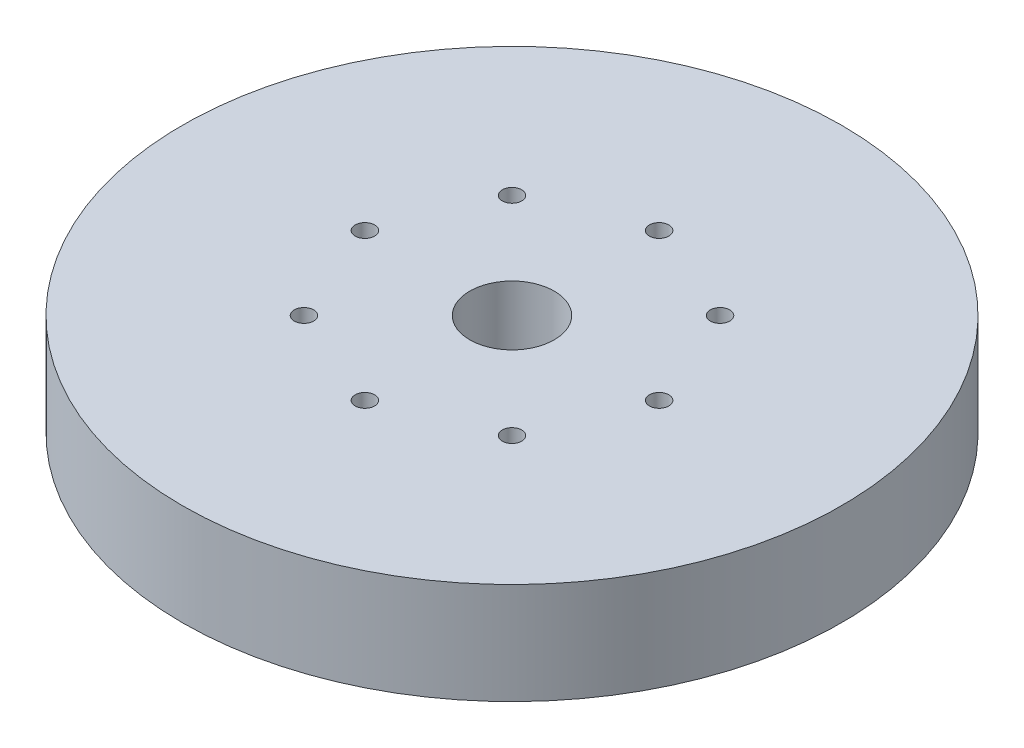
ISO-10303-21;
HEADER;
FILE_DESCRIPTION(('STEP AP214'),'2;1');
FILE_NAME('part.step','',(''),(''),'','','');
FILE_SCHEMA(('AUTOMOTIVE_DESIGN { 1 0 10303 214 1 1 1 1 }'));
ENDSEC;
DATA;
#1=APPLICATION_CONTEXT('core data for automotive mechanical design processes');
#2=APPLICATION_PROTOCOL_DEFINITION('international standard','automotive_design',2000,#1);
#3=PRODUCT_CONTEXT('',#1,'mechanical');
#4=PRODUCT('Part','Part','',(#3));
#5=PRODUCT_RELATED_PRODUCT_CATEGORY('part','',(#4));
#6=PRODUCT_DEFINITION_FORMATION('','',#4);
#7=PRODUCT_DEFINITION_CONTEXT('part definition',#1,'design');
#8=PRODUCT_DEFINITION('design','',#6,#7);
#9=PRODUCT_DEFINITION_SHAPE('','',#8);
#10=(LENGTH_UNIT() NAMED_UNIT(*) SI_UNIT(.MILLI.,.METRE.));
#11=(NAMED_UNIT(*) PLANE_ANGLE_UNIT() SI_UNIT($,.RADIAN.));
#12=(NAMED_UNIT(*) SI_UNIT($,.STERADIAN.) SOLID_ANGLE_UNIT());
#13=UNCERTAINTY_MEASURE_WITH_UNIT(LENGTH_MEASURE(1.E-05),#10,'distance_accuracy_value','');
#14=(GEOMETRIC_REPRESENTATION_CONTEXT(3) GLOBAL_UNCERTAINTY_ASSIGNED_CONTEXT((#13)) GLOBAL_UNIT_ASSIGNED_CONTEXT((#10,
#11,#12)) REPRESENTATION_CONTEXT('',''));
#15=CARTESIAN_POINT('',(0.,0.,0.));
#16=DIRECTION('',(0.,0.,1.));
#17=DIRECTION('',(1.,0.,0.));
#18=AXIS2_PLACEMENT_3D('',#15,#16,#17);
#19=CARTESIAN_POINT('',(0.,30.,0.));
#20=DIRECTION('',(0.,-1.,0.));
#21=DIRECTION('',(0.,0.,-1.));
#22=AXIS2_PLACEMENT_3D('',#19,#20,#21);
#23=CYLINDRICAL_SURFACE('',#22,97.5);
#24=CARTESIAN_POINT('',(0.,30.,0.));
#25=DIRECTION('',(0.,1.,0.));
#26=DIRECTION('',(0.,0.,1.));
#27=AXIS2_PLACEMENT_3D('',#24,#25,#26);
#28=CIRCLE('',#27,97.5);
#29=CARTESIAN_POINT('',(0.,30.,97.5));
#30=VERTEX_POINT('',#29);
#31=EDGE_CURVE('E10',#30,#30,#28,.T.);
#32=ORIENTED_EDGE('',*,*,#31,.F.);
#33=EDGE_LOOP('',(#32));
#34=FACE_BOUND('',#33,.T.);
#35=CARTESIAN_POINT('',(0.,0.,0.));
#36=DIRECTION('',(0.,1.,0.));
#37=DIRECTION('',(0.,0.,1.));
#38=AXIS2_PLACEMENT_3D('',#35,#36,#37);
#39=CIRCLE('',#38,97.5);
#40=CARTESIAN_POINT('',(0.,0.,97.5));
#41=VERTEX_POINT('',#40);
#42=EDGE_CURVE('E37',#41,#41,#39,.T.);
#43=ORIENTED_EDGE('',*,*,#42,.T.);
#44=EDGE_LOOP('',(#43));
#45=FACE_BOUND('',#44,.T.);
#46=ADVANCED_FACE('F40',(#34,#45),#23,.T.);
#47=CARTESIAN_POINT('',(0.,30.,0.));
#48=DIRECTION('',(0.,1.,0.));
#49=DIRECTION('',(0.,0.,1.));
#50=AXIS2_PLACEMENT_3D('',#47,#48,#49);
#51=PLANE('',#50);
#52=CARTESIAN_POINT('',(1.51956807422013E-13,30.,43.5221594145374));
#53=DIRECTION('',(0.,1.,0.));
#54=DIRECTION('',(1.,0.,0.));
#55=AXIS2_PLACEMENT_3D('',#52,#53,#54);
#56=CIRCLE('',#55,2.87571283902707);
#57=CARTESIAN_POINT('',(2.87571283902722,30.,43.5221594145374));
#58=VERTEX_POINT('',#57);
#59=EDGE_CURVE('E88',#58,#58,#56,.T.);
#60=ORIENTED_EDGE('',*,*,#59,.F.);
#61=EDGE_LOOP('',(#60));
#62=FACE_BOUND('',#61,.T.);
#63=CARTESIAN_POINT('',(30.7748140539015,30.,30.7748140539012));
#64=DIRECTION('',(0.,1.,0.));
#65=DIRECTION('',(0.707106781186544,0.,-0.707106781186551));
#66=AXIS2_PLACEMENT_3D('',#63,#64,#65);
#67=CIRCLE('',#66,2.87571283902707);
#68=CARTESIAN_POINT('',(32.8082501031228,30.,28.7413780046799));
#69=VERTEX_POINT('',#68);
#70=EDGE_CURVE('E79',#69,#69,#67,.T.);
#71=ORIENTED_EDGE('',*,*,#70,.F.);
#72=EDGE_LOOP('',(#71));
#73=FACE_BOUND('',#72,.T.);
#74=CARTESIAN_POINT('',(43.5221594145374,30.,0.));
#75=DIRECTION('',(0.,1.,0.));
#76=DIRECTION('',(0.,0.,-1.));
#77=AXIS2_PLACEMENT_3D('',#74,#75,#76);
#78=CIRCLE('',#77,2.87571283902707);
#79=CARTESIAN_POINT('',(43.5221594145374,30.,-2.87571283902707));
#80=VERTEX_POINT('',#79);
#81=EDGE_CURVE('E74',#80,#80,#78,.T.);
#82=ORIENTED_EDGE('',*,*,#81,.F.);
#83=EDGE_LOOP('',(#82));
#84=FACE_BOUND('',#83,.T.);
#85=CARTESIAN_POINT('',(30.7748140539011,30.,-30.7748140539016));
#86=DIRECTION('',(0.,1.,0.));
#87=DIRECTION('',(-0.707106781186554,0.,-0.707106781186541));
#88=AXIS2_PLACEMENT_3D('',#85,#86,#87);
#89=CIRCLE('',#88,2.87571283902707);
#90=CARTESIAN_POINT('',(28.7413780046798,30.,-32.8082501031229));
#91=VERTEX_POINT('',#90);
#92=EDGE_CURVE('E70',#91,#91,#89,.T.);
#93=ORIENTED_EDGE('',*,*,#92,.F.);
#94=EDGE_LOOP('',(#93));
#95=FACE_BOUND('',#94,.T.);
#96=CARTESIAN_POINT('',(-4.5587042226604E-13,30.,-43.5221594145374));
#97=DIRECTION('',(0.,1.,0.));
#98=DIRECTION('',(-1.,0.,0.));
#99=AXIS2_PLACEMENT_3D('',#96,#97,#98);
#100=CIRCLE('',#99,2.87571283902707);
#101=CARTESIAN_POINT('',(-2.87571283902752,30.,-43.5221594145374));
#102=VERTEX_POINT('',#101);
#103=EDGE_CURVE('E100',#102,#102,#100,.T.);
#104=ORIENTED_EDGE('',*,*,#103,.F.);
#105=EDGE_LOOP('',(#104));
#106=FACE_BOUND('',#105,.T.);
#107=CARTESIAN_POINT('',(-30.7748140539017,30.,-30.774814053901));
#108=DIRECTION('',(0.,1.,0.));
#109=DIRECTION('',(-0.707106781186539,0.,0.707106781186556));
#110=AXIS2_PLACEMENT_3D('',#107,#108,#109);
#111=CIRCLE('',#110,2.87571283902707);
#112=CARTESIAN_POINT('',(-32.808250103123,30.,-28.7413780046797));
#113=VERTEX_POINT('',#112);
#114=EDGE_CURVE('E93',#113,#113,#111,.T.);
#115=ORIENTED_EDGE('',*,*,#114,.F.);
#116=EDGE_LOOP('',(#115));
#117=FACE_BOUND('',#116,.T.);
#118=CARTESIAN_POINT('',(-30.7748140539013,30.,30.7748140539014));
#119=DIRECTION('',(0.,1.,0.));
#120=DIRECTION('',(0.707106781186549,0.,0.707106781186546));
#121=AXIS2_PLACEMENT_3D('',#118,#119,#120);
#122=CIRCLE('',#121,2.87571283902707);
#123=CARTESIAN_POINT('',(-28.7413780046801,30.,32.8082501031227));
#124=VERTEX_POINT('',#123);
#125=EDGE_CURVE('E61',#124,#124,#122,.T.);
#126=ORIENTED_EDGE('',*,*,#125,.F.);
#127=EDGE_LOOP('',(#126));
#128=FACE_BOUND('',#127,.T.);
#129=CARTESIAN_POINT('',(-43.5221594145374,30.,0.));
#130=DIRECTION('',(0.,1.,0.));
#131=DIRECTION('',(0.,0.,1.));
#132=AXIS2_PLACEMENT_3D('',#129,#130,#131);
#133=CIRCLE('',#132,2.87571283902707);
#134=CARTESIAN_POINT('',(-43.5221594145374,30.,2.87571283902707));
#135=VERTEX_POINT('',#134);
#136=EDGE_CURVE('E54',#135,#135,#133,.T.);
#137=ORIENTED_EDGE('',*,*,#136,.F.);
#138=EDGE_LOOP('',(#137));
#139=FACE_BOUND('',#138,.T.);
#140=CARTESIAN_POINT('',(0.,30.,0.));
#141=DIRECTION('',(0.,1.,0.));
#142=DIRECTION('',(0.,0.,1.));
#143=AXIS2_PLACEMENT_3D('',#140,#141,#142);
#144=CIRCLE('',#143,12.5);
#145=CARTESIAN_POINT('',(0.,30.,12.5));
#146=VERTEX_POINT('',#145);
#147=EDGE_CURVE('E50',#146,#146,#144,.T.);
#148=ORIENTED_EDGE('',*,*,#147,.F.);
#149=EDGE_LOOP('',(#148));
#150=FACE_BOUND('',#149,.T.);
#151=ORIENTED_EDGE('',*,*,#31,.T.);
#152=EDGE_LOOP('',(#151));
#153=FACE_BOUND('',#152,.T.);
#154=ADVANCED_FACE('F115',(#62,#73,#84,#95,#106,#117,#128,#139,#150,#153),#51,.T.);
#155=CARTESIAN_POINT('',(0.,0.,0.));
#156=DIRECTION('',(0.,1.,0.));
#157=DIRECTION('',(0.,0.,1.));
#158=AXIS2_PLACEMENT_3D('',#155,#156,#157);
#159=PLANE('',#158);
#160=CARTESIAN_POINT('',(0.,0.,0.));
#161=DIRECTION('',(0.,1.,0.));
#162=DIRECTION('',(0.,0.,1.));
#163=AXIS2_PLACEMENT_3D('',#160,#161,#162);
#164=CIRCLE('',#163,12.5);
#165=CARTESIAN_POINT('',(0.,0.,12.5));
#166=VERTEX_POINT('',#165);
#167=EDGE_CURVE('E47',#166,#166,#164,.T.);
#168=ORIENTED_EDGE('',*,*,#167,.T.);
#169=EDGE_LOOP('',(#168));
#170=FACE_BOUND('',#169,.T.);
#171=ORIENTED_EDGE('',*,*,#42,.F.);
#172=EDGE_LOOP('',(#171));
#173=FACE_BOUND('',#172,.T.);
#174=ADVANCED_FACE('F113',(#170,#173),#159,.F.);
#175=CARTESIAN_POINT('',(0.,30.,0.));
#176=DIRECTION('',(0.,-1.,0.));
#177=DIRECTION('',(0.,0.,-1.));
#178=AXIS2_PLACEMENT_3D('',#175,#176,#177);
#179=CYLINDRICAL_SURFACE('',#178,12.5);
#180=ORIENTED_EDGE('',*,*,#147,.T.);
#181=EDGE_LOOP('',(#180));
#182=FACE_BOUND('',#181,.T.);
#183=ORIENTED_EDGE('',*,*,#167,.F.);
#184=EDGE_LOOP('',(#183));
#185=FACE_BOUND('',#184,.T.);
#186=ADVANCED_FACE('F127',(#182,#185),#179,.F.);
#187=CARTESIAN_POINT('',(-43.5221594145374,7.41410904597395,0.));
#188=DIRECTION('',(0.,1.,0.));
#189=DIRECTION('',(0.,0.,1.));
#190=AXIS2_PLACEMENT_3D('',#187,#188,#189);
#191=CYLINDRICAL_SURFACE('',#190,2.87571283902707);
#192=CARTESIAN_POINT('',(-43.5221594145374,7.41410904597395,0.));
#193=DIRECTION('',(0.,1.,0.));
#194=DIRECTION('',(0.,0.,1.));
#195=AXIS2_PLACEMENT_3D('',#192,#193,#194);
#196=CIRCLE('',#195,2.87571283902707);
#197=CARTESIAN_POINT('',(-43.5221594145374,7.41410904597395,2.87571283902707));
#198=VERTEX_POINT('',#197);
#199=EDGE_CURVE('E55',#198,#198,#196,.T.);
#200=ORIENTED_EDGE('',*,*,#199,.F.);
#201=EDGE_LOOP('',(#200));
#202=FACE_BOUND('',#201,.T.);
#203=ORIENTED_EDGE('',*,*,#136,.T.);
#204=EDGE_LOOP('',(#203));
#205=FACE_BOUND('',#204,.T.);
#206=ADVANCED_FACE('F129',(#202,#205),#191,.F.);
#207=CARTESIAN_POINT('',(-43.5221594145374,7.41410904597395,0.));
#208=DIRECTION('',(0.,1.,0.));
#209=DIRECTION('',(0.,0.,1.));
#210=AXIS2_PLACEMENT_3D('',#207,#208,#209);
#211=PLANE('',#210);
#212=ORIENTED_EDGE('',*,*,#199,.T.);
#213=EDGE_LOOP('',(#212));
#214=FACE_BOUND('',#213,.T.);
#215=ADVANCED_FACE('F157',(#214),#211,.T.);
#216=CARTESIAN_POINT('',(-30.7748140539013,7.41410904597395,30.7748140539014));
#217=DIRECTION('',(0.,1.,0.));
#218=DIRECTION('',(0.,0.,1.));
#219=AXIS2_PLACEMENT_3D('',#216,#217,#218);
#220=CYLINDRICAL_SURFACE('',#219,2.87571283902707);
#221=CARTESIAN_POINT('',(-30.7748140539013,7.41410904597395,30.7748140539014));
#222=DIRECTION('',(0.,1.,0.));
#223=DIRECTION('',(0.707106781186549,0.,0.707106781186546));
#224=AXIS2_PLACEMENT_3D('',#221,#222,#223);
#225=CIRCLE('',#224,2.87571283902707);
#226=CARTESIAN_POINT('',(-28.7413780046801,7.41410904597395,32.8082501031227));
#227=VERTEX_POINT('',#226);
#228=EDGE_CURVE('E59',#227,#227,#225,.T.);
#229=ORIENTED_EDGE('',*,*,#228,.F.);
#230=EDGE_LOOP('',(#229));
#231=FACE_BOUND('',#230,.T.);
#232=ORIENTED_EDGE('',*,*,#125,.T.);
#233=EDGE_LOOP('',(#232));
#234=FACE_BOUND('',#233,.T.);
#235=ADVANCED_FACE('F170',(#231,#234),#220,.F.);
#236=CARTESIAN_POINT('',(-30.7748140539013,7.41410904597395,30.7748140539014));
#237=DIRECTION('',(0.,1.,0.));
#238=DIRECTION('',(0.707106781186549,0.,0.707106781186546));
#239=AXIS2_PLACEMENT_3D('',#236,#237,#238);
#240=PLANE('',#239);
#241=ORIENTED_EDGE('',*,*,#228,.T.);
#242=EDGE_LOOP('',(#241));
#243=FACE_BOUND('',#242,.T.);
#244=ADVANCED_FACE('F182',(#243),#240,.T.);
#245=CARTESIAN_POINT('',(-30.7748140539017,7.41410904597395,-30.774814053901));
#246=DIRECTION('',(0.,1.,0.));
#247=DIRECTION('',(0.,0.,1.));
#248=AXIS2_PLACEMENT_3D('',#245,#246,#247);
#249=CYLINDRICAL_SURFACE('',#248,2.87571283902707);
#250=CARTESIAN_POINT('',(-30.7748140539017,7.41410904597395,-30.774814053901));
#251=DIRECTION('',(0.,1.,0.));
#252=DIRECTION('',(-0.707106781186539,0.,0.707106781186556));
#253=AXIS2_PLACEMENT_3D('',#250,#251,#252);
#254=CIRCLE('',#253,2.87571283902707);
#255=CARTESIAN_POINT('',(-32.808250103123,7.41410904597395,-28.7413780046797));
#256=VERTEX_POINT('',#255);
#257=EDGE_CURVE('E94',#256,#256,#254,.T.);
#258=ORIENTED_EDGE('',*,*,#257,.F.);
#259=EDGE_LOOP('',(#258));
#260=FACE_BOUND('',#259,.T.);
#261=ORIENTED_EDGE('',*,*,#114,.T.);
#262=EDGE_LOOP('',(#261));
#263=FACE_BOUND('',#262,.T.);
#264=ADVANCED_FACE('F189',(#260,#263),#249,.F.);
#265=CARTESIAN_POINT('',(-30.7748140539017,7.41410904597395,-30.774814053901));
#266=DIRECTION('',(0.,1.,0.));
#267=DIRECTION('',(-0.707106781186539,0.,0.707106781186556));
#268=AXIS2_PLACEMENT_3D('',#265,#266,#267);
#269=PLANE('',#268);
#270=ORIENTED_EDGE('',*,*,#257,.T.);
#271=EDGE_LOOP('',(#270));
#272=FACE_BOUND('',#271,.T.);
#273=ADVANCED_FACE('F107',(#272),#269,.T.);
#274=CARTESIAN_POINT('',(-4.5587042226604E-13,7.41410904597395,-43.5221594145374));
#275=DIRECTION('',(0.,1.,0.));
#276=DIRECTION('',(0.,0.,1.));
#277=AXIS2_PLACEMENT_3D('',#274,#275,#276);
#278=CYLINDRICAL_SURFACE('',#277,2.87571283902707);
#279=CARTESIAN_POINT('',(-4.5587042226604E-13,7.41410904597395,-43.5221594145374));
#280=DIRECTION('',(0.,1.,0.));
#281=DIRECTION('',(-1.,0.,0.));
#282=AXIS2_PLACEMENT_3D('',#279,#280,#281);
#283=CIRCLE('',#282,2.87571283902707);
#284=CARTESIAN_POINT('',(-2.87571283902752,7.41410904597395,-43.5221594145374));
#285=VERTEX_POINT('',#284);
#286=EDGE_CURVE('E72',#285,#285,#283,.T.);
#287=ORIENTED_EDGE('',*,*,#286,.F.);
#288=EDGE_LOOP('',(#287));
#289=FACE_BOUND('',#288,.T.);
#290=ORIENTED_EDGE('',*,*,#103,.T.);
#291=EDGE_LOOP('',(#290));
#292=FACE_BOUND('',#291,.T.);
#293=ADVANCED_FACE('F104',(#289,#292),#278,.F.);
#294=CARTESIAN_POINT('',(-4.5587042226604E-13,7.41410904597395,-43.5221594145374));
#295=DIRECTION('',(0.,1.,0.));
#296=DIRECTION('',(-1.,0.,0.));
#297=AXIS2_PLACEMENT_3D('',#294,#295,#296);
#298=PLANE('',#297);
#299=ORIENTED_EDGE('',*,*,#286,.T.);
#300=EDGE_LOOP('',(#299));
#301=FACE_BOUND('',#300,.T.);
#302=ADVANCED_FACE('F103',(#301),#298,.T.);
#303=CARTESIAN_POINT('',(30.7748140539011,7.41410904597395,-30.7748140539016));
#304=DIRECTION('',(0.,1.,0.));
#305=DIRECTION('',(0.,0.,1.));
#306=AXIS2_PLACEMENT_3D('',#303,#304,#305);
#307=CYLINDRICAL_SURFACE('',#306,2.87571283902707);
#308=CARTESIAN_POINT('',(30.7748140539011,7.41410904597395,-30.7748140539016));
#309=DIRECTION('',(0.,1.,0.));
#310=DIRECTION('',(-0.707106781186554,0.,-0.707106781186541));
#311=AXIS2_PLACEMENT_3D('',#308,#309,#310);
#312=CIRCLE('',#311,2.87571283902707);
#313=CARTESIAN_POINT('',(28.7413780046798,7.41410904597395,-32.8082501031229));
#314=VERTEX_POINT('',#313);
#315=EDGE_CURVE('E69',#314,#314,#312,.T.);
#316=ORIENTED_EDGE('',*,*,#315,.F.);
#317=EDGE_LOOP('',(#316));
#318=FACE_BOUND('',#317,.T.);
#319=ORIENTED_EDGE('',*,*,#92,.T.);
#320=EDGE_LOOP('',(#319));
#321=FACE_BOUND('',#320,.T.);
#322=ADVANCED_FACE('F219',(#318,#321),#307,.F.);
#323=CARTESIAN_POINT('',(30.7748140539011,7.41410904597395,-30.7748140539016));
#324=DIRECTION('',(0.,1.,0.));
#325=DIRECTION('',(-0.707106781186554,0.,-0.707106781186541));
#326=AXIS2_PLACEMENT_3D('',#323,#324,#325);
#327=PLANE('',#326);
#328=ORIENTED_EDGE('',*,*,#315,.T.);
#329=EDGE_LOOP('',(#328));
#330=FACE_BOUND('',#329,.T.);
#331=ADVANCED_FACE('F227',(#330),#327,.T.);
#332=CARTESIAN_POINT('',(43.5221594145374,7.41410904597395,0.));
#333=DIRECTION('',(0.,1.,0.));
#334=DIRECTION('',(0.,0.,1.));
#335=AXIS2_PLACEMENT_3D('',#332,#333,#334);
#336=CYLINDRICAL_SURFACE('',#335,2.87571283902707);
#337=CARTESIAN_POINT('',(43.5221594145374,7.41410904597395,0.));
#338=DIRECTION('',(0.,1.,0.));
#339=DIRECTION('',(0.,0.,-1.));
#340=AXIS2_PLACEMENT_3D('',#337,#338,#339);
#341=CIRCLE('',#340,2.87571283902707);
#342=CARTESIAN_POINT('',(43.5221594145374,7.41410904597395,-2.87571283902707));
#343=VERTEX_POINT('',#342);
#344=EDGE_CURVE('E80',#343,#343,#341,.T.);
#345=ORIENTED_EDGE('',*,*,#344,.F.);
#346=EDGE_LOOP('',(#345));
#347=FACE_BOUND('',#346,.T.);
#348=ORIENTED_EDGE('',*,*,#81,.T.);
#349=EDGE_LOOP('',(#348));
#350=FACE_BOUND('',#349,.T.);
#351=ADVANCED_FACE('F240',(#347,#350),#336,.F.);
#352=CARTESIAN_POINT('',(43.5221594145374,7.41410904597395,0.));
#353=DIRECTION('',(0.,1.,0.));
#354=DIRECTION('',(0.,0.,-1.));
#355=AXIS2_PLACEMENT_3D('',#352,#353,#354);
#356=PLANE('',#355);
#357=ORIENTED_EDGE('',*,*,#344,.T.);
#358=EDGE_LOOP('',(#357));
#359=FACE_BOUND('',#358,.T.);
#360=ADVANCED_FACE('F246',(#359),#356,.T.);
#361=CARTESIAN_POINT('',(30.7748140539015,7.41410904597395,30.7748140539012));
#362=DIRECTION('',(0.,1.,0.));
#363=DIRECTION('',(0.,0.,1.));
#364=AXIS2_PLACEMENT_3D('',#361,#362,#363);
#365=CYLINDRICAL_SURFACE('',#364,2.87571283902707);
#366=CARTESIAN_POINT('',(30.7748140539015,7.41410904597395,30.7748140539012));
#367=DIRECTION('',(0.,1.,0.));
#368=DIRECTION('',(0.707106781186544,0.,-0.707106781186551));
#369=AXIS2_PLACEMENT_3D('',#366,#367,#368);
#370=CIRCLE('',#369,2.87571283902707);
#371=CARTESIAN_POINT('',(32.8082501031228,7.41410904597395,28.7413780046799));
#372=VERTEX_POINT('',#371);
#373=EDGE_CURVE('E82',#372,#372,#370,.T.);
#374=ORIENTED_EDGE('',*,*,#373,.F.);
#375=EDGE_LOOP('',(#374));
#376=FACE_BOUND('',#375,.T.);
#377=ORIENTED_EDGE('',*,*,#70,.T.);
#378=EDGE_LOOP('',(#377));
#379=FACE_BOUND('',#378,.T.);
#380=ADVANCED_FACE('F254',(#376,#379),#365,.F.);
#381=CARTESIAN_POINT('',(30.7748140539015,7.41410904597395,30.7748140539012));
#382=DIRECTION('',(0.,1.,0.));
#383=DIRECTION('',(0.707106781186544,0.,-0.707106781186551));
#384=AXIS2_PLACEMENT_3D('',#381,#382,#383);
#385=PLANE('',#384);
#386=ORIENTED_EDGE('',*,*,#373,.T.);
#387=EDGE_LOOP('',(#386));
#388=FACE_BOUND('',#387,.T.);
#389=ADVANCED_FACE('F262',(#388),#385,.T.);
#390=CARTESIAN_POINT('',(1.51956807422013E-13,7.41410904597395,43.5221594145374));
#391=DIRECTION('',(0.,1.,0.));
#392=DIRECTION('',(0.,0.,1.));
#393=AXIS2_PLACEMENT_3D('',#390,#391,#392);
#394=CYLINDRICAL_SURFACE('',#393,2.87571283902707);
#395=CARTESIAN_POINT('',(1.51956807422013E-13,7.41410904597395,43.5221594145374));
#396=DIRECTION('',(0.,1.,0.));
#397=DIRECTION('',(1.,0.,0.));
#398=AXIS2_PLACEMENT_3D('',#395,#396,#397);
#399=CIRCLE('',#398,2.87571283902707);
#400=CARTESIAN_POINT('',(2.87571283902722,7.41410904597395,43.5221594145374));
#401=VERTEX_POINT('',#400);
#402=EDGE_CURVE('E63',#401,#401,#399,.T.);
#403=ORIENTED_EDGE('',*,*,#402,.F.);
#404=EDGE_LOOP('',(#403));
#405=FACE_BOUND('',#404,.T.);
#406=ORIENTED_EDGE('',*,*,#59,.T.);
#407=EDGE_LOOP('',(#406));
#408=FACE_BOUND('',#407,.T.);
#409=ADVANCED_FACE('F272',(#405,#408),#394,.F.);
#410=CARTESIAN_POINT('',(1.51956807422013E-13,7.41410904597395,43.5221594145374));
#411=DIRECTION('',(0.,1.,0.));
#412=DIRECTION('',(1.,0.,0.));
#413=AXIS2_PLACEMENT_3D('',#410,#411,#412);
#414=PLANE('',#413);
#415=ORIENTED_EDGE('',*,*,#402,.T.);
#416=EDGE_LOOP('',(#415));
#417=FACE_BOUND('',#416,.T.);
#418=ADVANCED_FACE('F285',(#417),#414,.T.);
#419=CLOSED_SHELL('',(#46,#154,#174,#186,#206,#215,#235,#244,#264,#273,#293,#302,#322,#331,#351,
#360,#380,#389,#409,#418));
#420=MANIFOLD_SOLID_BREP('B2',#419);
#421=ADVANCED_BREP_SHAPE_REPRESENTATION('',(#18,#420),#14);
#422=SHAPE_DEFINITION_REPRESENTATION(#9,#421);
ENDSEC;
END-ISO-10303-21;
